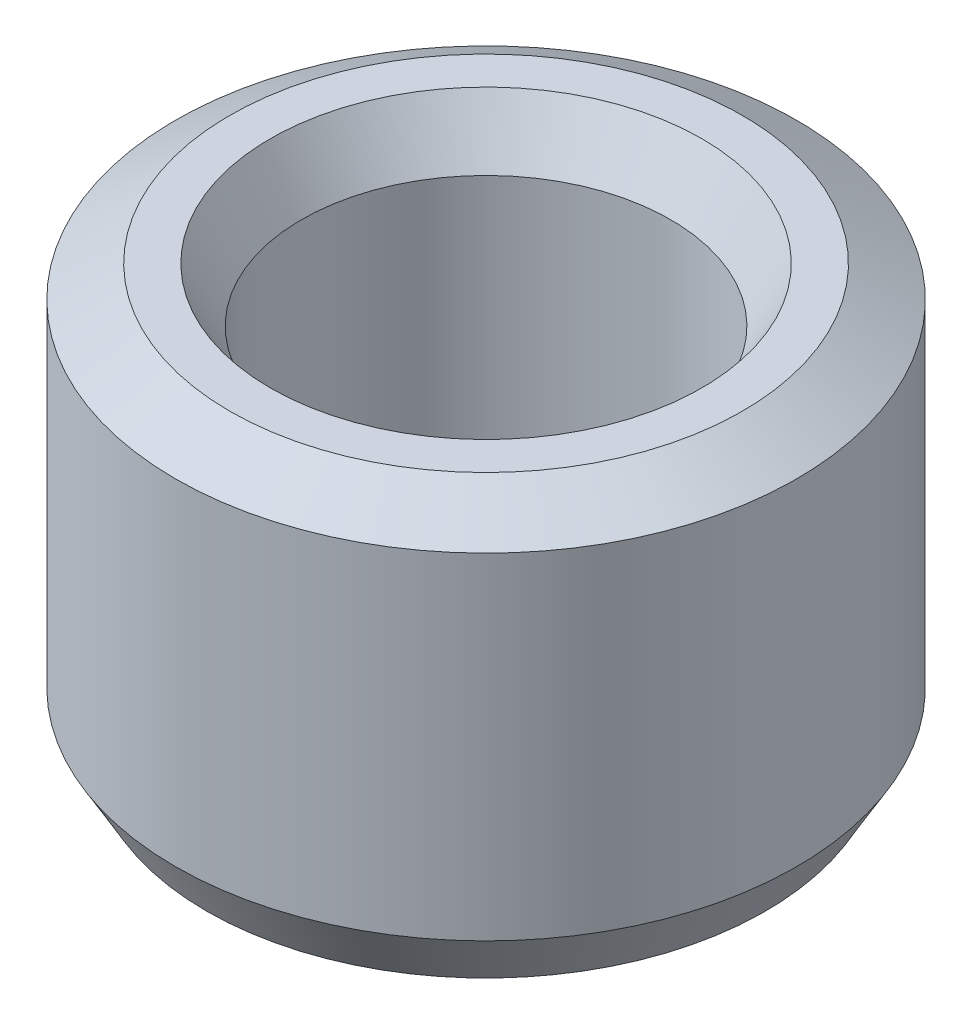
ISO-10303-21;
HEADER;
FILE_DESCRIPTION(('STEP AP214'),'2;1');
FILE_NAME('part.step','',(''),(''),'','','');
FILE_SCHEMA(('AUTOMOTIVE_DESIGN { 1 0 10303 214 1 1 1 1 }'));
ENDSEC;
DATA;
#1=APPLICATION_CONTEXT('core data for automotive mechanical design processes');
#2=APPLICATION_PROTOCOL_DEFINITION('international standard','automotive_design',2000,#1);
#3=PRODUCT_CONTEXT('',#1,'mechanical');
#4=PRODUCT('Part','Part','',(#3));
#5=PRODUCT_RELATED_PRODUCT_CATEGORY('part','',(#4));
#6=PRODUCT_DEFINITION_FORMATION('','',#4);
#7=PRODUCT_DEFINITION_CONTEXT('part definition',#1,'design');
#8=PRODUCT_DEFINITION('design','',#6,#7);
#9=PRODUCT_DEFINITION_SHAPE('','',#8);
#10=(LENGTH_UNIT() NAMED_UNIT(*) SI_UNIT(.MILLI.,.METRE.));
#11=(NAMED_UNIT(*) PLANE_ANGLE_UNIT() SI_UNIT($,.RADIAN.));
#12=(NAMED_UNIT(*) SI_UNIT($,.STERADIAN.) SOLID_ANGLE_UNIT());
#13=UNCERTAINTY_MEASURE_WITH_UNIT(LENGTH_MEASURE(1.E-05),#10,'distance_accuracy_value','');
#14=(GEOMETRIC_REPRESENTATION_CONTEXT(3) GLOBAL_UNCERTAINTY_ASSIGNED_CONTEXT((#13)) GLOBAL_UNIT_ASSIGNED_CONTEXT((#10,
#11,#12)) REPRESENTATION_CONTEXT('',''));
#15=CARTESIAN_POINT('',(0.,0.,0.));
#16=DIRECTION('',(0.,0.,1.));
#17=DIRECTION('',(1.,0.,0.));
#18=AXIS2_PLACEMENT_3D('',#15,#16,#17);
#19=CARTESIAN_POINT('',(0.,20.3578494958631,0.));
#20=DIRECTION('',(0.,-1.,0.));
#21=DIRECTION('',(0.,0.,-1.));
#22=AXIS2_PLACEMENT_3D('',#19,#20,#21);
#23=CYLINDRICAL_SURFACE('',#22,15.);
#24=CARTESIAN_POINT('',(0.,2.62488068860534,0.));
#25=DIRECTION('',(0.,1.,0.));
#26=DIRECTION('',(0.,0.,1.));
#27=AXIS2_PLACEMENT_3D('',#24,#25,#26);
#28=CIRCLE('',#27,15.);
#29=CARTESIAN_POINT('',(0.,2.62488068860534,15.));
#30=VERTEX_POINT('',#29);
#31=EDGE_CURVE('E10',#30,#30,#28,.T.);
#32=ORIENTED_EDGE('',*,*,#31,.T.);
#33=EDGE_LOOP('',(#32));
#34=FACE_BOUND('',#33,.T.);
#35=CARTESIAN_POINT('',(0.,18.8423739237061,0.));
#36=DIRECTION('',(0.,1.,0.));
#37=DIRECTION('',(0.,0.,1.));
#38=AXIS2_PLACEMENT_3D('',#35,#36,#37);
#39=CIRCLE('',#38,15.);
#40=CARTESIAN_POINT('',(0.,18.8423739237061,15.));
#41=VERTEX_POINT('',#40);
#42=EDGE_CURVE('E50',#41,#41,#39,.F.);
#43=ORIENTED_EDGE('',*,*,#42,.T.);
#44=EDGE_LOOP('',(#43));
#45=FACE_BOUND('',#44,.T.);
#46=ADVANCED_FACE('F39',(#34,#45),#23,.T.);
#47=CARTESIAN_POINT('',(0.,20.3578494958631,0.));
#48=DIRECTION('',(0.,1.,0.));
#49=DIRECTION('',(0.,0.,1.));
#50=AXIS2_PLACEMENT_3D('',#47,#48,#49);
#51=PLANE('',#50);
#52=CARTESIAN_POINT('',(0.,20.3578494958631,0.));
#53=DIRECTION('',(0.,1.,0.));
#54=DIRECTION('',(0.,0.,1.));
#55=AXIS2_PLACEMENT_3D('',#52,#53,#54);
#56=CIRCLE('',#55,10.423623011992);
#57=CARTESIAN_POINT('',(0.,20.3578494958631,10.423623011992));
#58=VERTEX_POINT('',#57);
#59=EDGE_CURVE('E58',#58,#58,#56,.F.);
#60=ORIENTED_EDGE('',*,*,#59,.T.);
#61=EDGE_LOOP('',(#60));
#62=FACE_BOUND('',#61,.T.);
#63=CARTESIAN_POINT('',(0.,20.3578494958631,0.));
#64=DIRECTION('',(0.,1.,0.));
#65=DIRECTION('',(0.,0.,1.));
#66=AXIS2_PLACEMENT_3D('',#63,#64,#65);
#67=CIRCLE('',#66,12.3751193113947);
#68=CARTESIAN_POINT('',(0.,20.3578494958631,12.3751193113947));
#69=VERTEX_POINT('',#68);
#70=EDGE_CURVE('E61',#69,#69,#67,.T.);
#71=ORIENTED_EDGE('',*,*,#70,.T.);
#72=EDGE_LOOP('',(#71));
#73=FACE_BOUND('',#72,.T.);
#74=ADVANCED_FACE('F88',(#62,#73),#51,.T.);
#75=CARTESIAN_POINT('',(0.,0.,0.));
#76=DIRECTION('',(0.,1.,0.));
#77=DIRECTION('',(0.,0.,1.));
#78=AXIS2_PLACEMENT_3D('',#75,#76,#77);
#79=PLANE('',#78);
#80=CARTESIAN_POINT('',(0.,0.,0.));
#81=DIRECTION('',(0.,1.,0.));
#82=DIRECTION('',(0.,0.,1.));
#83=AXIS2_PLACEMENT_3D('',#80,#81,#82);
#84=CIRCLE('',#83,11.5330281284403);
#85=CARTESIAN_POINT('',(0.,0.,11.5330281284403));
#86=VERTEX_POINT('',#85);
#87=EDGE_CURVE('E51',#86,#86,#84,.T.);
#88=ORIENTED_EDGE('',*,*,#87,.T.);
#89=EDGE_LOOP('',(#88));
#90=FACE_BOUND('',#89,.T.);
#91=CARTESIAN_POINT('',(0.,0.,0.));
#92=DIRECTION('',(0.,1.,0.));
#93=DIRECTION('',(0.,0.,1.));
#94=AXIS2_PLACEMENT_3D('',#91,#92,#93);
#95=CIRCLE('',#94,13.484524427843);
#96=CARTESIAN_POINT('',(0.,0.,13.484524427843));
#97=VERTEX_POINT('',#96);
#98=EDGE_CURVE('E54',#97,#97,#95,.F.);
#99=ORIENTED_EDGE('',*,*,#98,.T.);
#100=EDGE_LOOP('',(#99));
#101=FACE_BOUND('',#100,.T.);
#102=ADVANCED_FACE('F83',(#90,#101),#79,.F.);
#103=CARTESIAN_POINT('',(0.,20.3578494958631,0.));
#104=DIRECTION('',(0.,-1.,0.));
#105=DIRECTION('',(0.,0.,-1.));
#106=AXIS2_PLACEMENT_3D('',#103,#104,#105);
#107=CYLINDRICAL_SURFACE('',#106,8.90814743983501);
#108=CARTESIAN_POINT('',(0.,17.7329688072577,0.));
#109=DIRECTION('',(0.,1.,0.));
#110=DIRECTION('',(0.,0.,1.));
#111=AXIS2_PLACEMENT_3D('',#108,#109,#110);
#112=CIRCLE('',#111,8.90814743983501);
#113=CARTESIAN_POINT('',(0.,17.7329688072577,8.90814743983501));
#114=VERTEX_POINT('',#113);
#115=EDGE_CURVE('E67',#114,#114,#112,.T.);
#116=ORIENTED_EDGE('',*,*,#115,.T.);
#117=EDGE_LOOP('',(#116));
#118=FACE_BOUND('',#117,.T.);
#119=CARTESIAN_POINT('',(0.,1.51547557215695,0.));
#120=DIRECTION('',(0.,1.,0.));
#121=DIRECTION('',(0.,0.,1.));
#122=AXIS2_PLACEMENT_3D('',#119,#120,#121);
#123=CIRCLE('',#122,8.90814743983501);
#124=CARTESIAN_POINT('',(0.,1.51547557215695,8.90814743983501));
#125=VERTEX_POINT('',#124);
#126=EDGE_CURVE('E69',#125,#125,#123,.F.);
#127=ORIENTED_EDGE('',*,*,#126,.T.);
#128=EDGE_LOOP('',(#127));
#129=FACE_BOUND('',#128,.T.);
#130=ADVANCED_FACE('F71',(#118,#129),#107,.F.);
#131=CARTESIAN_POINT('',(0.,17.7329688072577,0.));
#132=DIRECTION('',(0.,1.,0.));
#133=DIRECTION('',(0.,0.,1.));
#134=AXIS2_PLACEMENT_3D('',#131,#132,#133);
#135=CONICAL_SURFACE('',#134,8.90814743983501,0.523598775598303);
#136=ORIENTED_EDGE('',*,*,#59,.F.);
#137=EDGE_LOOP('',(#136));
#138=FACE_BOUND('',#137,.T.);
#139=ORIENTED_EDGE('',*,*,#115,.F.);
#140=EDGE_LOOP('',(#139));
#141=FACE_BOUND('',#140,.T.);
#142=ADVANCED_FACE('F77',(#138,#141),#135,.F.);
#143=CARTESIAN_POINT('',(0.,0.,0.));
#144=DIRECTION('',(0.,-1.,0.));
#145=DIRECTION('',(0.,0.,-1.));
#146=AXIS2_PLACEMENT_3D('',#143,#144,#145);
#147=CONICAL_SURFACE('',#146,11.5330281284403,1.04719755119659);
#148=ORIENTED_EDGE('',*,*,#126,.F.);
#149=EDGE_LOOP('',(#148));
#150=FACE_BOUND('',#149,.T.);
#151=ORIENTED_EDGE('',*,*,#87,.F.);
#152=EDGE_LOOP('',(#151));
#153=FACE_BOUND('',#152,.T.);
#154=ADVANCED_FACE('F73',(#150,#153),#147,.F.);
#155=CARTESIAN_POINT('',(0.,2.62488068860534,0.));
#156=DIRECTION('',(0.,1.,0.));
#157=DIRECTION('',(0.,0.,1.));
#158=AXIS2_PLACEMENT_3D('',#155,#156,#157);
#159=CONICAL_SURFACE('',#158,15.,0.523598775598303);
#160=ORIENTED_EDGE('',*,*,#98,.F.);
#161=EDGE_LOOP('',(#160));
#162=FACE_BOUND('',#161,.T.);
#163=ORIENTED_EDGE('',*,*,#31,.F.);
#164=EDGE_LOOP('',(#163));
#165=FACE_BOUND('',#164,.T.);
#166=ADVANCED_FACE('F76',(#162,#165),#159,.T.);
#167=CARTESIAN_POINT('',(0.,20.3578494958631,0.));
#168=DIRECTION('',(0.,-1.,0.));
#169=DIRECTION('',(0.,0.,-1.));
#170=AXIS2_PLACEMENT_3D('',#167,#168,#169);
#171=CONICAL_SURFACE('',#170,12.3751193113947,1.04719755119659);
#172=ORIENTED_EDGE('',*,*,#42,.F.);
#173=EDGE_LOOP('',(#172));
#174=FACE_BOUND('',#173,.T.);
#175=ORIENTED_EDGE('',*,*,#70,.F.);
#176=EDGE_LOOP('',(#175));
#177=FACE_BOUND('',#176,.T.);
#178=ADVANCED_FACE('F45',(#174,#177),#171,.T.);
#179=CLOSED_SHELL('',(#46,#74,#102,#130,#142,#154,#166,#178));
#180=MANIFOLD_SOLID_BREP('B2',#179);
#181=ADVANCED_BREP_SHAPE_REPRESENTATION('',(#18,#180),#14);
#182=SHAPE_DEFINITION_REPRESENTATION(#9,#181);
ENDSEC;
END-ISO-10303-21;
